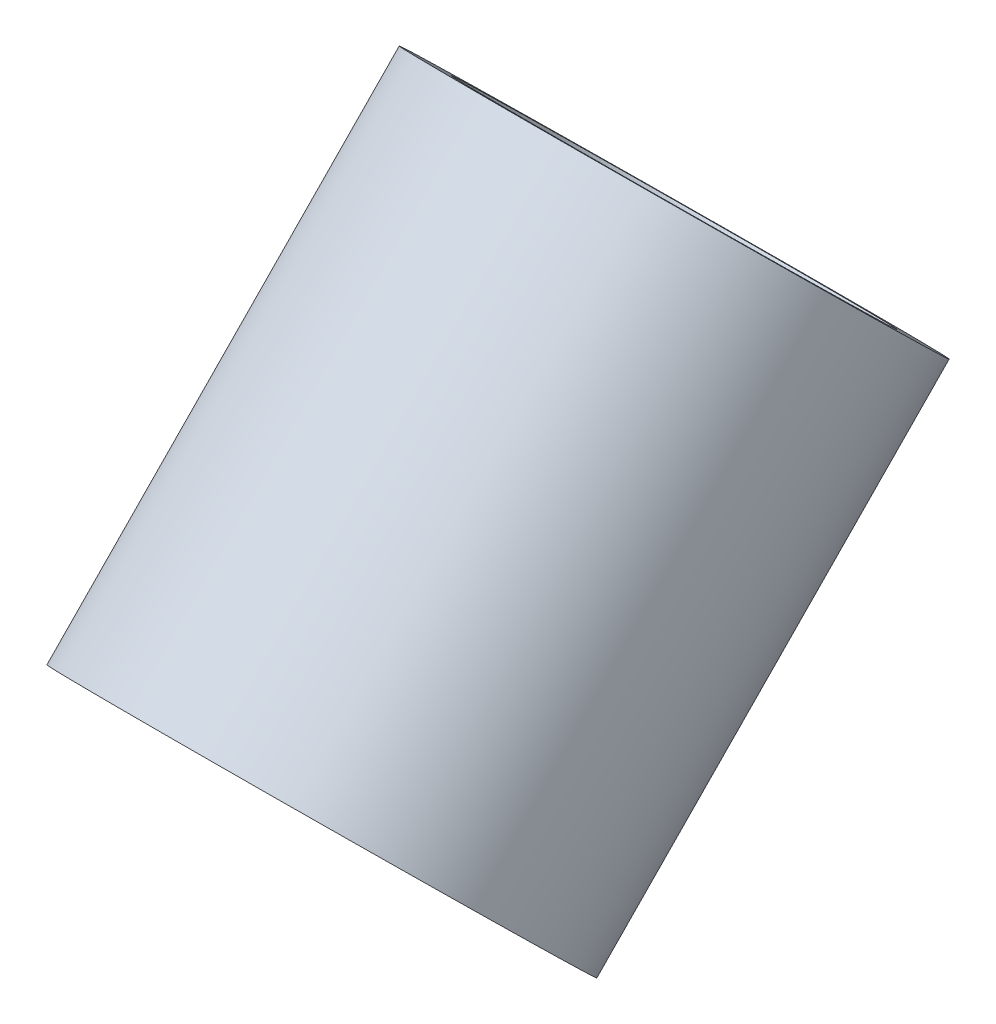
ISO-10303-21;
HEADER;
FILE_DESCRIPTION(('STEP AP214'),'2;1');
FILE_NAME('part.step','',(''),(''),'','','');
FILE_SCHEMA(('AUTOMOTIVE_DESIGN { 1 0 10303 214 1 1 1 1 }'));
ENDSEC;
DATA;
#1=APPLICATION_CONTEXT('core data for automotive mechanical design processes');
#2=APPLICATION_PROTOCOL_DEFINITION('international standard','automotive_design',2000,#1);
#3=PRODUCT_CONTEXT('',#1,'mechanical');
#4=PRODUCT('Part','Part','',(#3));
#5=PRODUCT_RELATED_PRODUCT_CATEGORY('part','',(#4));
#6=PRODUCT_DEFINITION_FORMATION('','',#4);
#7=PRODUCT_DEFINITION_CONTEXT('part definition',#1,'design');
#8=PRODUCT_DEFINITION('design','',#6,#7);
#9=PRODUCT_DEFINITION_SHAPE('','',#8);
#10=(LENGTH_UNIT() NAMED_UNIT(*) SI_UNIT(.MILLI.,.METRE.));
#11=(NAMED_UNIT(*) PLANE_ANGLE_UNIT() SI_UNIT($,.RADIAN.));
#12=(NAMED_UNIT(*) SI_UNIT($,.STERADIAN.) SOLID_ANGLE_UNIT());
#13=UNCERTAINTY_MEASURE_WITH_UNIT(LENGTH_MEASURE(1.E-05),#10,'distance_accuracy_value','');
#14=(GEOMETRIC_REPRESENTATION_CONTEXT(3) GLOBAL_UNCERTAINTY_ASSIGNED_CONTEXT((#13)) GLOBAL_UNIT_ASSIGNED_CONTEXT((#10,
#11,#12)) REPRESENTATION_CONTEXT('',''));
#15=CARTESIAN_POINT('',(0.,0.,0.));
#16=DIRECTION('',(0.,0.,1.));
#17=DIRECTION('',(1.,0.,0.));
#18=AXIS2_PLACEMENT_3D('',#15,#16,#17);
#19=CARTESIAN_POINT('',(0.,502.377755771854,1515.02730617));
#20=DIRECTION('',(0.,0.714472679632801,-0.699663340513368));
#21=DIRECTION('',(0.,0.699663340513368,0.714472679632801));
#22=AXIS2_PLACEMENT_3D('',#19,#20,#21);
#23=PLANE('',#22);
#24=CARTESIAN_POINT('',(0.,502.377755771854,1515.02730617));
#25=DIRECTION('',(0.,0.714472679632801,-0.699663340513368));
#26=DIRECTION('',(0.,0.699663340513368,0.714472679632801));
#27=AXIS2_PLACEMENT_3D('',#24,#25,#26);
#28=CIRCLE('',#27,25.4);
#29=CARTESIAN_POINT('',(0.,520.149204620894,1533.17491223267));
#30=VERTEX_POINT('',#29);
#31=EDGE_CURVE('E10',#30,#30,#28,.T.);
#32=ORIENTED_EDGE('',*,*,#31,.T.);
#33=EDGE_LOOP('',(#32));
#34=FACE_BOUND('',#33,.T.);
#35=CARTESIAN_POINT('',(0.,502.377755771854,1515.02730617));
#36=DIRECTION('',(0.,0.714472679632801,-0.699663340513368));
#37=DIRECTION('',(0.,0.699663340513368,0.714472679632801));
#38=AXIS2_PLACEMENT_3D('',#35,#36,#37);
#39=CIRCLE('',#38,20.6374999999999);
#40=CARTESIAN_POINT('',(0.,516.817057961699,1529.77223609592));
#41=VERTEX_POINT('',#40);
#42=EDGE_CURVE('E44',#41,#41,#39,.T.);
#43=ORIENTED_EDGE('',*,*,#42,.F.);
#44=EDGE_LOOP('',(#43));
#45=FACE_BOUND('',#44,.T.);
#46=ADVANCED_FACE('F33',(#34,#45),#23,.T.);
#47=CARTESIAN_POINT('',(0.,461.545642130839,1555.01306608034));
#48=DIRECTION('',(0.,0.714472679632801,-0.699663340513368));
#49=DIRECTION('',(0.,0.699663340513368,0.714472679632801));
#50=AXIS2_PLACEMENT_3D('',#47,#48,#49);
#51=PLANE('',#50);
#52=CARTESIAN_POINT('',(0.,461.545642130839,1555.01306608034));
#53=DIRECTION('',(0.,0.714472679632801,-0.699663340513368));
#54=DIRECTION('',(0.,0.699663340513368,0.714472679632801));
#55=AXIS2_PLACEMENT_3D('',#52,#53,#54);
#56=CIRCLE('',#55,25.4);
#57=CARTESIAN_POINT('',(0.,479.317090979879,1573.16067214301));
#58=VERTEX_POINT('',#57);
#59=EDGE_CURVE('E37',#58,#58,#56,.T.);
#60=ORIENTED_EDGE('',*,*,#59,.F.);
#61=EDGE_LOOP('',(#60));
#62=FACE_BOUND('',#61,.T.);
#63=CARTESIAN_POINT('',(0.,461.545642130839,1555.01306608034));
#64=DIRECTION('',(0.,0.714472679632801,-0.699663340513368));
#65=DIRECTION('',(0.,0.699663340513368,0.714472679632801));
#66=AXIS2_PLACEMENT_3D('',#63,#64,#65);
#67=CIRCLE('',#66,20.6374999999999);
#68=CARTESIAN_POINT('',(0.,475.984944320684,1569.75799600626));
#69=VERTEX_POINT('',#68);
#70=EDGE_CURVE('E46',#69,#69,#67,.T.);
#71=ORIENTED_EDGE('',*,*,#70,.T.);
#72=EDGE_LOOP('',(#71));
#73=FACE_BOUND('',#72,.T.);
#74=ADVANCED_FACE('F56',(#62,#73),#51,.F.);
#75=CARTESIAN_POINT('',(0.,502.377755771854,1515.02730617));
#76=DIRECTION('',(0.,-0.714472679632801,0.699663340513368));
#77=DIRECTION('',(0.,-0.699663340513368,-0.714472679632801));
#78=AXIS2_PLACEMENT_3D('',#75,#76,#77);
#79=CYLINDRICAL_SURFACE('',#78,25.4);
#80=ORIENTED_EDGE('',*,*,#31,.F.);
#81=EDGE_LOOP('',(#80));
#82=FACE_BOUND('',#81,.T.);
#83=ORIENTED_EDGE('',*,*,#59,.T.);
#84=EDGE_LOOP('',(#83));
#85=FACE_BOUND('',#84,.T.);
#86=ADVANCED_FACE('F35',(#82,#85),#79,.T.);
#87=CARTESIAN_POINT('',(0.,502.377755771854,1515.02730617));
#88=DIRECTION('',(0.,-0.714472679632801,0.699663340513368));
#89=DIRECTION('',(0.,-0.699663340513368,-0.714472679632801));
#90=AXIS2_PLACEMENT_3D('',#87,#88,#89);
#91=CYLINDRICAL_SURFACE('',#90,20.6374999999999);
#92=ORIENTED_EDGE('',*,*,#42,.T.);
#93=EDGE_LOOP('',(#92));
#94=FACE_BOUND('',#93,.T.);
#95=ORIENTED_EDGE('',*,*,#70,.F.);
#96=EDGE_LOOP('',(#95));
#97=FACE_BOUND('',#96,.T.);
#98=ADVANCED_FACE('F52',(#94,#97),#91,.F.);
#99=CLOSED_SHELL('',(#46,#74,#86,#98));
#100=MANIFOLD_SOLID_BREP('B2',#99);
#101=ADVANCED_BREP_SHAPE_REPRESENTATION('',(#18,#100),#14);
#102=SHAPE_DEFINITION_REPRESENTATION(#9,#101);
ENDSEC;
END-ISO-10303-21;
